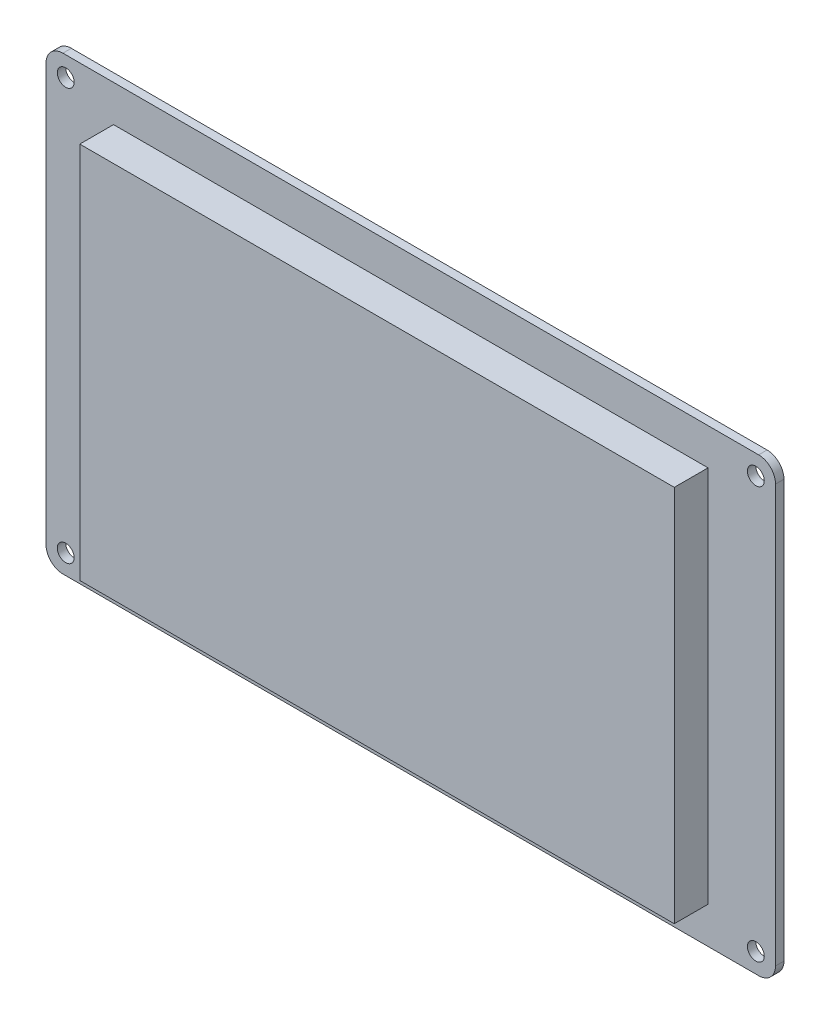
ISO-10303-21;
HEADER;
FILE_DESCRIPTION(('STEP AP214'),'2;1');
FILE_NAME('part.step','',(''),(''),'','','');
FILE_SCHEMA(('AUTOMOTIVE_DESIGN { 1 0 10303 214 1 1 1 1 }'));
ENDSEC;
DATA;
#1=APPLICATION_CONTEXT('core data for automotive mechanical design processes');
#2=APPLICATION_PROTOCOL_DEFINITION('international standard','automotive_design',2000,#1);
#3=PRODUCT_CONTEXT('',#1,'mechanical');
#4=PRODUCT('Part','Part','',(#3));
#5=PRODUCT_RELATED_PRODUCT_CATEGORY('part','',(#4));
#6=PRODUCT_DEFINITION_FORMATION('','',#4);
#7=PRODUCT_DEFINITION_CONTEXT('part definition',#1,'design');
#8=PRODUCT_DEFINITION('design','',#6,#7);
#9=PRODUCT_DEFINITION_SHAPE('','',#8);
#10=(LENGTH_UNIT() NAMED_UNIT(*) SI_UNIT(.MILLI.,.METRE.));
#11=(NAMED_UNIT(*) PLANE_ANGLE_UNIT() SI_UNIT($,.RADIAN.));
#12=(NAMED_UNIT(*) SI_UNIT($,.STERADIAN.) SOLID_ANGLE_UNIT());
#13=UNCERTAINTY_MEASURE_WITH_UNIT(LENGTH_MEASURE(1.E-05),#10,'distance_accuracy_value','');
#14=(GEOMETRIC_REPRESENTATION_CONTEXT(3) GLOBAL_UNCERTAINTY_ASSIGNED_CONTEXT((#13)) GLOBAL_UNIT_ASSIGNED_CONTEXT((#10,
#11,#12)) REPRESENTATION_CONTEXT('',''));
#15=CARTESIAN_POINT('',(0.,0.,0.));
#16=DIRECTION('',(0.,0.,1.));
#17=DIRECTION('',(1.,0.,0.));
#18=AXIS2_PLACEMENT_3D('',#15,#16,#17);
#19=CARTESIAN_POINT('',(-52.85,33.6,6.));
#20=DIRECTION('',(1.,0.,0.));
#21=DIRECTION('',(0.,0.,-1.));
#22=AXIS2_PLACEMENT_3D('',#19,#20,#21);
#23=PLANE('',#22);
#24=DIRECTION('',(0.,-1.,0.));
#25=VECTOR('',#24,1.);
#26=CARTESIAN_POINT('',(-52.85,33.6,0.));
#27=LINE('',#26,#25);
#28=CARTESIAN_POINT('',(-52.85,33.6,0.));
#29=VERTEX_POINT('',#28);
#30=CARTESIAN_POINT('',(-52.85,-33.6,0.));
#31=VERTEX_POINT('',#30);
#32=EDGE_CURVE('E125',#29,#31,#27,.T.);
#33=ORIENTED_EDGE('',*,*,#32,.T.);
#34=DIRECTION('',(0.,0.,-1.));
#35=VECTOR('',#34,1.);
#36=CARTESIAN_POINT('',(-52.85,-33.6,6.));
#37=LINE('',#36,#35);
#38=CARTESIAN_POINT('',(-52.85,-33.6,6.));
#39=VERTEX_POINT('',#38);
#40=EDGE_CURVE('E134',#39,#31,#37,.T.);
#41=ORIENTED_EDGE('',*,*,#40,.F.);
#42=DIRECTION('',(0.,-1.,0.));
#43=VECTOR('',#42,1.);
#44=CARTESIAN_POINT('',(-52.85,33.6,6.));
#45=LINE('',#44,#43);
#46=CARTESIAN_POINT('',(-52.85,33.6,6.));
#47=VERTEX_POINT('',#46);
#48=EDGE_CURVE('E158',#47,#39,#45,.T.);
#49=ORIENTED_EDGE('',*,*,#48,.F.);
#50=DIRECTION('',(0.,0.,-1.));
#51=VECTOR('',#50,1.);
#52=CARTESIAN_POINT('',(-52.85,33.6,6.));
#53=LINE('',#52,#51);
#54=EDGE_CURVE('E145',#47,#29,#53,.T.);
#55=ORIENTED_EDGE('',*,*,#54,.T.);
#56=EDGE_LOOP('',(#33,#41,#49,#55));
#57=FACE_BOUND('',#56,.T.);
#58=ADVANCED_FACE('F32',(#57),#23,.F.);
#59=CARTESIAN_POINT('',(-52.85,-33.6,6.));
#60=DIRECTION('',(0.,1.,0.));
#61=DIRECTION('',(0.,0.,1.));
#62=AXIS2_PLACEMENT_3D('',#59,#60,#61);
#63=PLANE('',#62);
#64=DIRECTION('',(1.,0.,0.));
#65=VECTOR('',#64,1.);
#66=CARTESIAN_POINT('',(-52.85,-33.6,0.));
#67=LINE('',#66,#65);
#68=CARTESIAN_POINT('',(52.85,-33.6,0.));
#69=VERTEX_POINT('',#68);
#70=EDGE_CURVE('E121',#31,#69,#67,.T.);
#71=ORIENTED_EDGE('',*,*,#70,.T.);
#72=DIRECTION('',(0.,0.,-1.));
#73=VECTOR('',#72,1.);
#74=CARTESIAN_POINT('',(52.85,-33.6,6.));
#75=LINE('',#74,#73);
#76=CARTESIAN_POINT('',(52.85,-33.6,6.));
#77=VERTEX_POINT('',#76);
#78=EDGE_CURVE('E141',#77,#69,#75,.T.);
#79=ORIENTED_EDGE('',*,*,#78,.F.);
#80=DIRECTION('',(1.,0.,0.));
#81=VECTOR('',#80,1.);
#82=CARTESIAN_POINT('',(-52.85,-33.6,6.));
#83=LINE('',#82,#81);
#84=EDGE_CURVE('E136',#39,#77,#83,.T.);
#85=ORIENTED_EDGE('',*,*,#84,.F.);
#86=ORIENTED_EDGE('',*,*,#40,.T.);
#87=EDGE_LOOP('',(#71,#79,#85,#86));
#88=FACE_BOUND('',#87,.T.);
#89=ADVANCED_FACE('F135',(#88),#63,.F.);
#90=CARTESIAN_POINT('',(52.85,33.6,6.));
#91=DIRECTION('',(-1.,0.,0.));
#92=DIRECTION('',(0.,-1.,0.));
#93=AXIS2_PLACEMENT_3D('',#90,#91,#92);
#94=PLANE('',#93);
#95=DIRECTION('',(0.,1.,0.));
#96=VECTOR('',#95,1.);
#97=CARTESIAN_POINT('',(52.85,33.6,0.));
#98=LINE('',#97,#96);
#99=CARTESIAN_POINT('',(52.85,33.6,0.));
#100=VERTEX_POINT('',#99);
#101=EDGE_CURVE('E128',#69,#100,#98,.T.);
#102=ORIENTED_EDGE('',*,*,#101,.T.);
#103=DIRECTION('',(0.,0.,-1.));
#104=VECTOR('',#103,1.);
#105=CARTESIAN_POINT('',(52.85,33.6,6.));
#106=LINE('',#105,#104);
#107=CARTESIAN_POINT('',(52.85,33.6,6.));
#108=VERTEX_POINT('',#107);
#109=EDGE_CURVE('E160',#108,#100,#106,.T.);
#110=ORIENTED_EDGE('',*,*,#109,.F.);
#111=DIRECTION('',(0.,1.,0.));
#112=VECTOR('',#111,1.);
#113=CARTESIAN_POINT('',(52.85,33.6,6.));
#114=LINE('',#113,#112);
#115=EDGE_CURVE('E222',#77,#108,#114,.T.);
#116=ORIENTED_EDGE('',*,*,#115,.F.);
#117=ORIENTED_EDGE('',*,*,#78,.T.);
#118=EDGE_LOOP('',(#102,#110,#116,#117));
#119=FACE_BOUND('',#118,.T.);
#120=ADVANCED_FACE('F231',(#119),#94,.F.);
#121=CARTESIAN_POINT('',(-52.85,33.6,6.));
#122=DIRECTION('',(0.,-1.,0.));
#123=DIRECTION('',(0.,0.,-1.));
#124=AXIS2_PLACEMENT_3D('',#121,#122,#123);
#125=PLANE('',#124);
#126=DIRECTION('',(-1.,0.,0.));
#127=VECTOR('',#126,1.);
#128=CARTESIAN_POINT('',(-52.85,33.6,0.));
#129=LINE('',#128,#127);
#130=EDGE_CURVE('E156',#100,#29,#129,.T.);
#131=ORIENTED_EDGE('',*,*,#130,.T.);
#132=ORIENTED_EDGE('',*,*,#54,.F.);
#133=DIRECTION('',(-1.,0.,0.));
#134=VECTOR('',#133,1.);
#135=CARTESIAN_POINT('',(-52.85,33.6,6.));
#136=LINE('',#135,#134);
#137=EDGE_CURVE('E152',#108,#47,#136,.T.);
#138=ORIENTED_EDGE('',*,*,#137,.F.);
#139=ORIENTED_EDGE('',*,*,#109,.T.);
#140=EDGE_LOOP('',(#131,#132,#138,#139));
#141=FACE_BOUND('',#140,.T.);
#142=ADVANCED_FACE('F229',(#141),#125,.F.);
#143=CARTESIAN_POINT('',(0.,0.,6.));
#144=DIRECTION('',(0.,0.,1.));
#145=DIRECTION('',(1.,0.,0.));
#146=AXIS2_PLACEMENT_3D('',#143,#144,#145);
#147=PLANE('',#146);
#148=ORIENTED_EDGE('',*,*,#48,.T.);
#149=ORIENTED_EDGE('',*,*,#84,.T.);
#150=ORIENTED_EDGE('',*,*,#115,.T.);
#151=ORIENTED_EDGE('',*,*,#137,.T.);
#152=EDGE_LOOP('',(#148,#149,#150,#151));
#153=FACE_BOUND('',#152,.T.);
#154=ADVANCED_FACE('F227',(#153),#147,.T.);
#155=CARTESIAN_POINT('',(0.,0.,0.));
#156=DIRECTION('',(0.,0.,1.));
#157=DIRECTION('',(1.,0.,0.));
#158=AXIS2_PLACEMENT_3D('',#155,#156,#157);
#159=PLANE('',#158);
#160=CARTESIAN_POINT('',(-61.35,36.6,0.));
#161=DIRECTION('',(0.,0.,1.));
#162=DIRECTION('',(-1.,0.,0.));
#163=AXIS2_PLACEMENT_3D('',#160,#161,#162);
#164=CIRCLE('',#163,1.5);
#165=CARTESIAN_POINT('',(-62.85,36.6,0.));
#166=VERTEX_POINT('',#165);
#167=EDGE_CURVE('E277',#166,#166,#164,.T.);
#168=ORIENTED_EDGE('',*,*,#167,.F.);
#169=EDGE_LOOP('',(#168));
#170=FACE_BOUND('',#169,.T.);
#171=CARTESIAN_POINT('',(-61.35,-36.6,0.));
#172=DIRECTION('',(0.,0.,1.));
#173=DIRECTION('',(-1.,0.,0.));
#174=AXIS2_PLACEMENT_3D('',#171,#172,#173);
#175=CIRCLE('',#174,1.5);
#176=CARTESIAN_POINT('',(-62.85,-36.6,0.));
#177=VERTEX_POINT('',#176);
#178=EDGE_CURVE('E283',#177,#177,#175,.T.);
#179=ORIENTED_EDGE('',*,*,#178,.F.);
#180=EDGE_LOOP('',(#179));
#181=FACE_BOUND('',#180,.T.);
#182=CARTESIAN_POINT('',(61.35,-36.6,0.));
#183=DIRECTION('',(0.,0.,1.));
#184=DIRECTION('',(1.,0.,0.));
#185=AXIS2_PLACEMENT_3D('',#182,#183,#184);
#186=CIRCLE('',#185,1.5);
#187=CARTESIAN_POINT('',(62.85,-36.6,0.));
#188=VERTEX_POINT('',#187);
#189=EDGE_CURVE('E289',#188,#188,#186,.T.);
#190=ORIENTED_EDGE('',*,*,#189,.F.);
#191=EDGE_LOOP('',(#190));
#192=FACE_BOUND('',#191,.T.);
#193=CARTESIAN_POINT('',(61.35,36.6,0.));
#194=DIRECTION('',(0.,0.,1.));
#195=DIRECTION('',(1.,0.,0.));
#196=AXIS2_PLACEMENT_3D('',#193,#194,#195);
#197=CIRCLE('',#196,1.5);
#198=CARTESIAN_POINT('',(62.85,36.6,0.));
#199=VERTEX_POINT('',#198);
#200=EDGE_CURVE('E213',#199,#199,#197,.T.);
#201=ORIENTED_EDGE('',*,*,#200,.F.);
#202=EDGE_LOOP('',(#201));
#203=FACE_BOUND('',#202,.T.);
#204=DIRECTION('',(-1.,0.,0.));
#205=VECTOR('',#204,1.);
#206=CARTESIAN_POINT('',(64.85,-40.1,0.));
#207=LINE('',#206,#205);
#208=CARTESIAN_POINT('',(61.85,-40.1,0.));
#209=VERTEX_POINT('',#208);
#210=CARTESIAN_POINT('',(-61.85,-40.1,0.));
#211=VERTEX_POINT('',#210);
#212=EDGE_CURVE('E219',#209,#211,#207,.T.);
#213=ORIENTED_EDGE('',*,*,#212,.F.);
#214=CARTESIAN_POINT('',(61.85,-37.1,0.));
#215=DIRECTION('',(0.,0.,1.));
#216=DIRECTION('',(1.,0.,0.));
#217=AXIS2_PLACEMENT_3D('',#214,#215,#216);
#218=CIRCLE('',#217,3.);
#219=CARTESIAN_POINT('',(64.85,-37.1,0.));
#220=VERTEX_POINT('',#219);
#221=EDGE_CURVE('E174',#209,#220,#218,.T.);
#222=ORIENTED_EDGE('',*,*,#221,.T.);
#223=DIRECTION('',(0.,-1.,0.));
#224=VECTOR('',#223,1.);
#225=CARTESIAN_POINT('',(64.85,-40.1,0.));
#226=LINE('',#225,#224);
#227=CARTESIAN_POINT('',(64.85,37.1,0.));
#228=VERTEX_POINT('',#227);
#229=EDGE_CURVE('E210',#228,#220,#226,.T.);
#230=ORIENTED_EDGE('',*,*,#229,.F.);
#231=CARTESIAN_POINT('',(61.85,37.1,0.));
#232=DIRECTION('',(0.,0.,1.));
#233=DIRECTION('',(1.,0.,0.));
#234=AXIS2_PLACEMENT_3D('',#231,#232,#233);
#235=CIRCLE('',#234,3.);
#236=CARTESIAN_POINT('',(61.85,40.1,0.));
#237=VERTEX_POINT('',#236);
#238=EDGE_CURVE('E168',#228,#237,#235,.T.);
#239=ORIENTED_EDGE('',*,*,#238,.T.);
#240=DIRECTION('',(1.,0.,0.));
#241=VECTOR('',#240,1.);
#242=CARTESIAN_POINT('',(64.85,40.1,0.));
#243=LINE('',#242,#241);
#244=CARTESIAN_POINT('',(-61.85,40.1,0.));
#245=VERTEX_POINT('',#244);
#246=EDGE_CURVE('E207',#245,#237,#243,.T.);
#247=ORIENTED_EDGE('',*,*,#246,.F.);
#248=CARTESIAN_POINT('',(-61.85,37.1,0.));
#249=DIRECTION('',(0.,0.,1.));
#250=DIRECTION('',(1.,0.,0.));
#251=AXIS2_PLACEMENT_3D('',#248,#249,#250);
#252=CIRCLE('',#251,3.);
#253=CARTESIAN_POINT('',(-64.85,37.1,0.));
#254=VERTEX_POINT('',#253);
#255=EDGE_CURVE('E170',#245,#254,#252,.T.);
#256=ORIENTED_EDGE('',*,*,#255,.T.);
#257=DIRECTION('',(0.,1.,0.));
#258=VECTOR('',#257,1.);
#259=CARTESIAN_POINT('',(-64.85,-40.1,0.));
#260=LINE('',#259,#258);
#261=CARTESIAN_POINT('',(-64.85,-37.1,0.));
#262=VERTEX_POINT('',#261);
#263=EDGE_CURVE('E198',#262,#254,#260,.T.);
#264=ORIENTED_EDGE('',*,*,#263,.F.);
#265=CARTESIAN_POINT('',(-61.85,-37.1,0.));
#266=DIRECTION('',(0.,0.,1.));
#267=DIRECTION('',(1.,0.,0.));
#268=AXIS2_PLACEMENT_3D('',#265,#266,#267);
#269=CIRCLE('',#268,3.);
#270=EDGE_CURVE('E172',#262,#211,#269,.T.);
#271=ORIENTED_EDGE('',*,*,#270,.T.);
#272=EDGE_LOOP('',(#213,#222,#230,#239,#247,#256,#264,#271));
#273=FACE_BOUND('',#272,.T.);
#274=ORIENTED_EDGE('',*,*,#32,.F.);
#275=ORIENTED_EDGE('',*,*,#130,.F.);
#276=ORIENTED_EDGE('',*,*,#101,.F.);
#277=ORIENTED_EDGE('',*,*,#70,.F.);
#278=EDGE_LOOP('',(#274,#275,#276,#277));
#279=FACE_BOUND('',#278,.T.);
#280=ADVANCED_FACE('F123',(#170,#181,#192,#203,#273,#279),#159,.T.);
#281=CARTESIAN_POINT('',(-64.85,-40.1,-1.5));
#282=DIRECTION('',(1.,0.,0.));
#283=DIRECTION('',(0.,0.,-1.));
#284=AXIS2_PLACEMENT_3D('',#281,#282,#283);
#285=PLANE('',#284);
#286=DIRECTION('',(0.,1.,0.));
#287=VECTOR('',#286,1.);
#288=CARTESIAN_POINT('',(-64.85,-40.1,-1.5));
#289=LINE('',#288,#287);
#290=CARTESIAN_POINT('',(-64.85,-37.1,-1.5));
#291=VERTEX_POINT('',#290);
#292=CARTESIAN_POINT('',(-64.85,37.1,-1.5));
#293=VERTEX_POINT('',#292);
#294=EDGE_CURVE('E200',#291,#293,#289,.T.);
#295=ORIENTED_EDGE('',*,*,#294,.F.);
#296=DIRECTION('',(0.,0.,1.));
#297=VECTOR('',#296,1.);
#298=CARTESIAN_POINT('',(-64.85,-37.1,-1.5));
#299=LINE('',#298,#297);
#300=EDGE_CURVE('E190',#291,#262,#299,.T.);
#301=ORIENTED_EDGE('',*,*,#300,.T.);
#302=ORIENTED_EDGE('',*,*,#263,.T.);
#303=DIRECTION('',(0.,0.,1.));
#304=VECTOR('',#303,1.);
#305=CARTESIAN_POINT('',(-64.85,37.1,-1.5));
#306=LINE('',#305,#304);
#307=EDGE_CURVE('E188',#254,#293,#306,.F.);
#308=ORIENTED_EDGE('',*,*,#307,.T.);
#309=EDGE_LOOP('',(#295,#301,#302,#308));
#310=FACE_BOUND('',#309,.T.);
#311=ADVANCED_FACE('F197',(#310),#285,.F.);
#312=CARTESIAN_POINT('',(64.85,40.1,-1.5));
#313=DIRECTION('',(0.,-1.,0.));
#314=DIRECTION('',(0.,0.,-1.));
#315=AXIS2_PLACEMENT_3D('',#312,#313,#314);
#316=PLANE('',#315);
#317=DIRECTION('',(1.,0.,0.));
#318=VECTOR('',#317,1.);
#319=CARTESIAN_POINT('',(64.85,40.1,-1.5));
#320=LINE('',#319,#318);
#321=CARTESIAN_POINT('',(-61.85,40.1,-1.5));
#322=VERTEX_POINT('',#321);
#323=CARTESIAN_POINT('',(61.85,40.1,-1.5));
#324=VERTEX_POINT('',#323);
#325=EDGE_CURVE('E261',#322,#324,#320,.T.);
#326=ORIENTED_EDGE('',*,*,#325,.F.);
#327=DIRECTION('',(0.,0.,1.));
#328=VECTOR('',#327,1.);
#329=CARTESIAN_POINT('',(-61.85,40.1,-1.5));
#330=LINE('',#329,#328);
#331=EDGE_CURVE('E11',#322,#245,#330,.T.);
#332=ORIENTED_EDGE('',*,*,#331,.T.);
#333=ORIENTED_EDGE('',*,*,#246,.T.);
#334=DIRECTION('',(0.,0.,1.));
#335=VECTOR('',#334,1.);
#336=CARTESIAN_POINT('',(61.85,40.1,-1.5));
#337=LINE('',#336,#335);
#338=EDGE_CURVE('E40',#237,#324,#337,.F.);
#339=ORIENTED_EDGE('',*,*,#338,.T.);
#340=EDGE_LOOP('',(#326,#332,#333,#339));
#341=FACE_BOUND('',#340,.T.);
#342=ADVANCED_FACE('F260',(#341),#316,.F.);
#343=CARTESIAN_POINT('',(64.85,-40.1,-1.5));
#344=DIRECTION('',(-1.,0.,0.));
#345=DIRECTION('',(0.,0.,1.));
#346=AXIS2_PLACEMENT_3D('',#343,#344,#345);
#347=PLANE('',#346);
#348=ORIENTED_EDGE('',*,*,#229,.T.);
#349=DIRECTION('',(0.,0.,1.));
#350=VECTOR('',#349,1.);
#351=CARTESIAN_POINT('',(64.85,-37.1,-1.5));
#352=LINE('',#351,#350);
#353=CARTESIAN_POINT('',(64.85,-37.1,-1.5));
#354=VERTEX_POINT('',#353);
#355=EDGE_CURVE('E179',#220,#354,#352,.F.);
#356=ORIENTED_EDGE('',*,*,#355,.T.);
#357=DIRECTION('',(0.,-1.,0.));
#358=VECTOR('',#357,1.);
#359=CARTESIAN_POINT('',(64.85,-40.1,-1.5));
#360=LINE('',#359,#358);
#361=CARTESIAN_POINT('',(64.85,37.1,-1.5));
#362=VERTEX_POINT('',#361);
#363=EDGE_CURVE('E149',#362,#354,#360,.T.);
#364=ORIENTED_EDGE('',*,*,#363,.F.);
#365=DIRECTION('',(0.,0.,1.));
#366=VECTOR('',#365,1.);
#367=CARTESIAN_POINT('',(64.85,37.1,-1.5));
#368=LINE('',#367,#366);
#369=EDGE_CURVE('E176',#362,#228,#368,.T.);
#370=ORIENTED_EDGE('',*,*,#369,.T.);
#371=EDGE_LOOP('',(#348,#356,#364,#370));
#372=FACE_BOUND('',#371,.T.);
#373=ADVANCED_FACE('F267',(#372),#347,.F.);
#374=CARTESIAN_POINT('',(64.85,-40.1,-1.5));
#375=DIRECTION('',(0.,1.,0.));
#376=DIRECTION('',(0.,0.,1.));
#377=AXIS2_PLACEMENT_3D('',#374,#375,#376);
#378=PLANE('',#377);
#379=DIRECTION('',(-1.,0.,0.));
#380=VECTOR('',#379,1.);
#381=CARTESIAN_POINT('',(64.85,-40.1,-1.5));
#382=LINE('',#381,#380);
#383=CARTESIAN_POINT('',(61.85,-40.1,-1.5));
#384=VERTEX_POINT('',#383);
#385=CARTESIAN_POINT('',(-61.85,-40.1,-1.5));
#386=VERTEX_POINT('',#385);
#387=EDGE_CURVE('E146',#384,#386,#382,.T.);
#388=ORIENTED_EDGE('',*,*,#387,.F.);
#389=DIRECTION('',(0.,0.,1.));
#390=VECTOR('',#389,1.);
#391=CARTESIAN_POINT('',(61.85,-40.1,-1.5));
#392=LINE('',#391,#390);
#393=EDGE_CURVE('E165',#384,#209,#392,.T.);
#394=ORIENTED_EDGE('',*,*,#393,.T.);
#395=ORIENTED_EDGE('',*,*,#212,.T.);
#396=DIRECTION('',(0.,0.,1.));
#397=VECTOR('',#396,1.);
#398=CARTESIAN_POINT('',(-61.85,-40.1,-1.5));
#399=LINE('',#398,#397);
#400=EDGE_CURVE('E140',#211,#386,#399,.F.);
#401=ORIENTED_EDGE('',*,*,#400,.T.);
#402=EDGE_LOOP('',(#388,#394,#395,#401));
#403=FACE_BOUND('',#402,.T.);
#404=ADVANCED_FACE('F318',(#403),#378,.F.);
#405=CARTESIAN_POINT('',(0.,0.,-1.5));
#406=DIRECTION('',(0.,0.,1.));
#407=DIRECTION('',(1.,0.,0.));
#408=AXIS2_PLACEMENT_3D('',#405,#406,#407);
#409=PLANE('',#408);
#410=CARTESIAN_POINT('',(-61.35,36.6,-1.5));
#411=DIRECTION('',(0.,0.,1.));
#412=DIRECTION('',(-1.,0.,0.));
#413=AXIS2_PLACEMENT_3D('',#410,#411,#412);
#414=CIRCLE('',#413,1.5);
#415=CARTESIAN_POINT('',(-62.85,36.6,-1.5));
#416=VERTEX_POINT('',#415);
#417=EDGE_CURVE('E280',#416,#416,#414,.T.);
#418=ORIENTED_EDGE('',*,*,#417,.T.);
#419=EDGE_LOOP('',(#418));
#420=FACE_BOUND('',#419,.T.);
#421=CARTESIAN_POINT('',(-61.35,-36.6,-1.5));
#422=DIRECTION('',(0.,0.,1.));
#423=DIRECTION('',(-1.,0.,0.));
#424=AXIS2_PLACEMENT_3D('',#421,#422,#423);
#425=CIRCLE('',#424,1.5);
#426=CARTESIAN_POINT('',(-62.85,-36.6,-1.5));
#427=VERTEX_POINT('',#426);
#428=EDGE_CURVE('E286',#427,#427,#425,.T.);
#429=ORIENTED_EDGE('',*,*,#428,.T.);
#430=EDGE_LOOP('',(#429));
#431=FACE_BOUND('',#430,.T.);
#432=CARTESIAN_POINT('',(61.35,-36.6,-1.5));
#433=DIRECTION('',(0.,0.,1.));
#434=DIRECTION('',(1.,0.,0.));
#435=AXIS2_PLACEMENT_3D('',#432,#433,#434);
#436=CIRCLE('',#435,1.5);
#437=CARTESIAN_POINT('',(62.85,-36.6,-1.5));
#438=VERTEX_POINT('',#437);
#439=EDGE_CURVE('E275',#438,#438,#436,.T.);
#440=ORIENTED_EDGE('',*,*,#439,.T.);
#441=EDGE_LOOP('',(#440));
#442=FACE_BOUND('',#441,.T.);
#443=CARTESIAN_POINT('',(61.35,36.6,-1.5));
#444=DIRECTION('',(0.,0.,1.));
#445=DIRECTION('',(1.,0.,0.));
#446=AXIS2_PLACEMENT_3D('',#443,#444,#445);
#447=CIRCLE('',#446,1.5);
#448=CARTESIAN_POINT('',(62.85,36.6,-1.5));
#449=VERTEX_POINT('',#448);
#450=EDGE_CURVE('E208',#449,#449,#447,.T.);
#451=ORIENTED_EDGE('',*,*,#450,.T.);
#452=EDGE_LOOP('',(#451));
#453=FACE_BOUND('',#452,.T.);
#454=ORIENTED_EDGE('',*,*,#363,.T.);
#455=CARTESIAN_POINT('',(61.85,-37.1,-1.5));
#456=DIRECTION('',(0.,0.,1.));
#457=DIRECTION('',(1.,0.,0.));
#458=AXIS2_PLACEMENT_3D('',#455,#456,#457);
#459=CIRCLE('',#458,3.);
#460=EDGE_CURVE('E186',#354,#384,#459,.F.);
#461=ORIENTED_EDGE('',*,*,#460,.T.);
#462=ORIENTED_EDGE('',*,*,#387,.T.);
#463=CARTESIAN_POINT('',(-61.85,-37.1,-1.5));
#464=DIRECTION('',(0.,0.,1.));
#465=DIRECTION('',(1.,0.,0.));
#466=AXIS2_PLACEMENT_3D('',#463,#464,#465);
#467=CIRCLE('',#466,3.);
#468=EDGE_CURVE('E184',#386,#291,#467,.F.);
#469=ORIENTED_EDGE('',*,*,#468,.T.);
#470=ORIENTED_EDGE('',*,*,#294,.T.);
#471=CARTESIAN_POINT('',(-61.85,37.1,-1.5));
#472=DIRECTION('',(0.,0.,1.));
#473=DIRECTION('',(1.,0.,0.));
#474=AXIS2_PLACEMENT_3D('',#471,#472,#473);
#475=CIRCLE('',#474,3.);
#476=EDGE_CURVE('E53',#293,#322,#475,.F.);
#477=ORIENTED_EDGE('',*,*,#476,.T.);
#478=ORIENTED_EDGE('',*,*,#325,.T.);
#479=CARTESIAN_POINT('',(61.85,37.1,-1.5));
#480=DIRECTION('',(0.,0.,1.));
#481=DIRECTION('',(1.,0.,0.));
#482=AXIS2_PLACEMENT_3D('',#479,#480,#481);
#483=CIRCLE('',#482,3.);
#484=EDGE_CURVE('E181',#324,#362,#483,.F.);
#485=ORIENTED_EDGE('',*,*,#484,.T.);
#486=EDGE_LOOP('',(#454,#461,#462,#469,#470,#477,#478,#485));
#487=FACE_BOUND('',#486,.T.);
#488=ADVANCED_FACE('F295',(#420,#431,#442,#453,#487),#409,.F.);
#489=CARTESIAN_POINT('',(61.35,36.6,-1.5));
#490=DIRECTION('',(0.,0.,1.));
#491=DIRECTION('',(1.,0.,0.));
#492=AXIS2_PLACEMENT_3D('',#489,#490,#491);
#493=CYLINDRICAL_SURFACE('',#492,1.5);
#494=ORIENTED_EDGE('',*,*,#450,.F.);
#495=EDGE_LOOP('',(#494));
#496=FACE_BOUND('',#495,.T.);
#497=ORIENTED_EDGE('',*,*,#200,.T.);
#498=EDGE_LOOP('',(#497));
#499=FACE_BOUND('',#498,.T.);
#500=ADVANCED_FACE('F302',(#496,#499),#493,.F.);
#501=CARTESIAN_POINT('',(61.35,-36.6,-1.5));
#502=DIRECTION('',(0.,0.,1.));
#503=DIRECTION('',(1.,0.,0.));
#504=AXIS2_PLACEMENT_3D('',#501,#502,#503);
#505=CYLINDRICAL_SURFACE('',#504,1.5);
#506=ORIENTED_EDGE('',*,*,#439,.F.);
#507=EDGE_LOOP('',(#506));
#508=FACE_BOUND('',#507,.T.);
#509=ORIENTED_EDGE('',*,*,#189,.T.);
#510=EDGE_LOOP('',(#509));
#511=FACE_BOUND('',#510,.T.);
#512=ADVANCED_FACE('F298',(#508,#511),#505,.F.);
#513=CARTESIAN_POINT('',(-61.35,-36.6,-1.5));
#514=DIRECTION('',(0.,0.,1.));
#515=DIRECTION('',(1.,0.,0.));
#516=AXIS2_PLACEMENT_3D('',#513,#514,#515);
#517=CYLINDRICAL_SURFACE('',#516,1.5);
#518=ORIENTED_EDGE('',*,*,#428,.F.);
#519=EDGE_LOOP('',(#518));
#520=FACE_BOUND('',#519,.T.);
#521=ORIENTED_EDGE('',*,*,#178,.T.);
#522=EDGE_LOOP('',(#521));
#523=FACE_BOUND('',#522,.T.);
#524=ADVANCED_FACE('F301',(#520,#523),#517,.F.);
#525=CARTESIAN_POINT('',(-61.35,36.6,-1.5));
#526=DIRECTION('',(0.,0.,1.));
#527=DIRECTION('',(1.,0.,0.));
#528=AXIS2_PLACEMENT_3D('',#525,#526,#527);
#529=CYLINDRICAL_SURFACE('',#528,1.5);
#530=ORIENTED_EDGE('',*,*,#417,.F.);
#531=EDGE_LOOP('',(#530));
#532=FACE_BOUND('',#531,.T.);
#533=ORIENTED_EDGE('',*,*,#167,.T.);
#534=EDGE_LOOP('',(#533));
#535=FACE_BOUND('',#534,.T.);
#536=ADVANCED_FACE('F249',(#532,#535),#529,.F.);
#537=CARTESIAN_POINT('',(61.85,-37.1,-1.5));
#538=DIRECTION('',(0.,0.,1.));
#539=DIRECTION('',(1.,0.,0.));
#540=AXIS2_PLACEMENT_3D('',#537,#538,#539);
#541=CYLINDRICAL_SURFACE('',#540,3.);
#542=ORIENTED_EDGE('',*,*,#460,.F.);
#543=ORIENTED_EDGE('',*,*,#355,.F.);
#544=ORIENTED_EDGE('',*,*,#221,.F.);
#545=ORIENTED_EDGE('',*,*,#393,.F.);
#546=EDGE_LOOP('',(#542,#543,#544,#545));
#547=FACE_BOUND('',#546,.T.);
#548=ADVANCED_FACE('F245',(#547),#541,.T.);
#549=CARTESIAN_POINT('',(-61.85,-37.1,-1.5));
#550=DIRECTION('',(0.,0.,1.));
#551=DIRECTION('',(1.,0.,0.));
#552=AXIS2_PLACEMENT_3D('',#549,#550,#551);
#553=CYLINDRICAL_SURFACE('',#552,3.);
#554=ORIENTED_EDGE('',*,*,#468,.F.);
#555=ORIENTED_EDGE('',*,*,#400,.F.);
#556=ORIENTED_EDGE('',*,*,#270,.F.);
#557=ORIENTED_EDGE('',*,*,#300,.F.);
#558=EDGE_LOOP('',(#554,#555,#556,#557));
#559=FACE_BOUND('',#558,.T.);
#560=ADVANCED_FACE('F248',(#559),#553,.T.);
#561=CARTESIAN_POINT('',(-61.85,37.1,-1.5));
#562=DIRECTION('',(0.,0.,1.));
#563=DIRECTION('',(1.,0.,0.));
#564=AXIS2_PLACEMENT_3D('',#561,#562,#563);
#565=CYLINDRICAL_SURFACE('',#564,3.);
#566=ORIENTED_EDGE('',*,*,#476,.F.);
#567=ORIENTED_EDGE('',*,*,#307,.F.);
#568=ORIENTED_EDGE('',*,*,#255,.F.);
#569=ORIENTED_EDGE('',*,*,#331,.F.);
#570=EDGE_LOOP('',(#566,#567,#568,#569));
#571=FACE_BOUND('',#570,.T.);
#572=ADVANCED_FACE('F252',(#571),#565,.T.);
#573=CARTESIAN_POINT('',(61.85,37.1,-1.5));
#574=DIRECTION('',(0.,0.,1.));
#575=DIRECTION('',(1.,0.,0.));
#576=AXIS2_PLACEMENT_3D('',#573,#574,#575);
#577=CYLINDRICAL_SURFACE('',#576,3.);
#578=ORIENTED_EDGE('',*,*,#484,.F.);
#579=ORIENTED_EDGE('',*,*,#338,.F.);
#580=ORIENTED_EDGE('',*,*,#238,.F.);
#581=ORIENTED_EDGE('',*,*,#369,.F.);
#582=EDGE_LOOP('',(#578,#579,#580,#581));
#583=FACE_BOUND('',#582,.T.);
#584=ADVANCED_FACE('F34',(#583),#577,.T.);
#585=CLOSED_SHELL('',(#58,#89,#120,#142,#154,#280,#311,#342,#373,#404,#488,#500,#512,#524,#536,
#548,#560,#572,#584));
#586=MANIFOLD_SOLID_BREP('B2',#585);
#587=ADVANCED_BREP_SHAPE_REPRESENTATION('',(#18,#586),#14);
#588=SHAPE_DEFINITION_REPRESENTATION(#9,#587);
ENDSEC;
END-ISO-10303-21;
